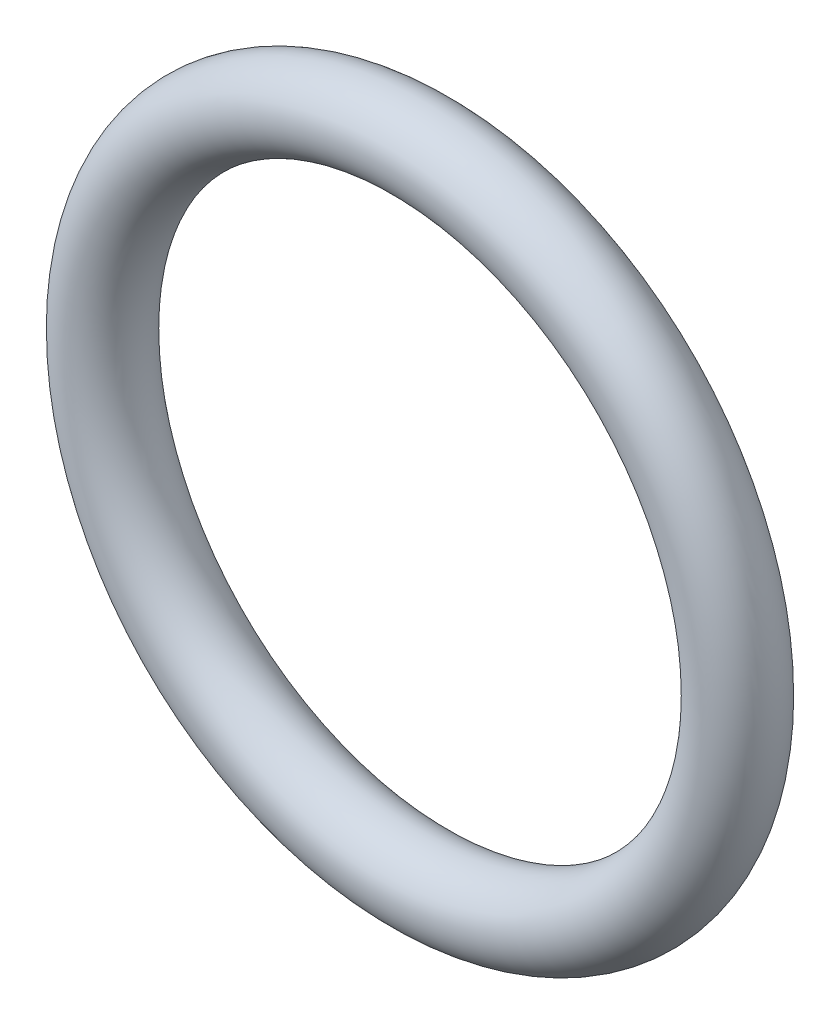
ISO-10303-21;
HEADER;
FILE_DESCRIPTION(('STEP AP214'),'2;1');
FILE_NAME('part.step','',(''),(''),'','','');
FILE_SCHEMA(('AUTOMOTIVE_DESIGN { 1 0 10303 214 1 1 1 1 }'));
ENDSEC;
DATA;
#1=APPLICATION_CONTEXT('core data for automotive mechanical design processes');
#2=APPLICATION_PROTOCOL_DEFINITION('international standard','automotive_design',2000,#1);
#3=PRODUCT_CONTEXT('',#1,'mechanical');
#4=PRODUCT('Part','Part','',(#3));
#5=PRODUCT_RELATED_PRODUCT_CATEGORY('part','',(#4));
#6=PRODUCT_DEFINITION_FORMATION('','',#4);
#7=PRODUCT_DEFINITION_CONTEXT('part definition',#1,'design');
#8=PRODUCT_DEFINITION('design','',#6,#7);
#9=PRODUCT_DEFINITION_SHAPE('','',#8);
#10=(LENGTH_UNIT() NAMED_UNIT(*) SI_UNIT(.MILLI.,.METRE.));
#11=(NAMED_UNIT(*) PLANE_ANGLE_UNIT() SI_UNIT($,.RADIAN.));
#12=(NAMED_UNIT(*) SI_UNIT($,.STERADIAN.) SOLID_ANGLE_UNIT());
#13=UNCERTAINTY_MEASURE_WITH_UNIT(LENGTH_MEASURE(1.E-05),#10,'distance_accuracy_value','');
#14=(GEOMETRIC_REPRESENTATION_CONTEXT(3) GLOBAL_UNCERTAINTY_ASSIGNED_CONTEXT((#13)) GLOBAL_UNIT_ASSIGNED_CONTEXT((#10,
#11,#12)) REPRESENTATION_CONTEXT('',''));
#15=CARTESIAN_POINT('',(0.,0.,0.));
#16=DIRECTION('',(0.,0.,1.));
#17=DIRECTION('',(1.,0.,0.));
#18=AXIS2_PLACEMENT_3D('',#15,#16,#17);
#19=CARTESIAN_POINT('',(0.,0.,0.));
#20=DIRECTION('',(0.,0.,1.));
#21=DIRECTION('',(1.,0.,0.));
#22=AXIS2_PLACEMENT_3D('',#19,#20,#21);
#23=TOROIDAL_SURFACE('',#22,7.0993,0.888999999999998);
#24=CARTESIAN_POINT('',(7.9883,0.,0.));
#25=VERTEX_POINT('',#24);
#26=VERTEX_LOOP('',#25);
#27=FACE_BOUND('',#26,.T.);
#28=ADVANCED_FACE('F33',(#27),#23,.T.);
#29=CLOSED_SHELL('',(#28));
#30=MANIFOLD_SOLID_BREP('B2',#29);
#31=ADVANCED_BREP_SHAPE_REPRESENTATION('',(#18,#30),#14);
#32=SHAPE_DEFINITION_REPRESENTATION(#9,#31);
ENDSEC;
END-ISO-10303-21;
